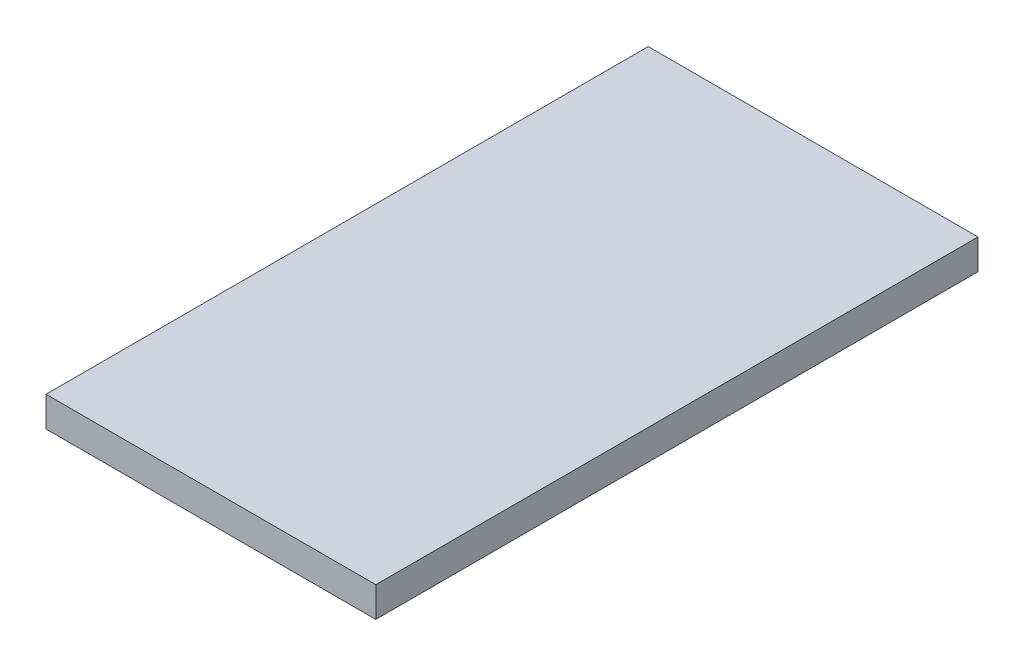
ISO-10303-21;
HEADER;
FILE_DESCRIPTION(('STEP AP214'),'2;1');
FILE_NAME('part.step','',(''),(''),'','','');
FILE_SCHEMA(('AUTOMOTIVE_DESIGN { 1 0 10303 214 1 1 1 1 }'));
ENDSEC;
DATA;
#1=APPLICATION_CONTEXT('core data for automotive mechanical design processes');
#2=APPLICATION_PROTOCOL_DEFINITION('international standard','automotive_design',2000,#1);
#3=PRODUCT_CONTEXT('',#1,'mechanical');
#4=PRODUCT('Part','Part','',(#3));
#5=PRODUCT_RELATED_PRODUCT_CATEGORY('part','',(#4));
#6=PRODUCT_DEFINITION_FORMATION('','',#4);
#7=PRODUCT_DEFINITION_CONTEXT('part definition',#1,'design');
#8=PRODUCT_DEFINITION('design','',#6,#7);
#9=PRODUCT_DEFINITION_SHAPE('','',#8);
#10=(LENGTH_UNIT() NAMED_UNIT(*) SI_UNIT(.MILLI.,.METRE.));
#11=(NAMED_UNIT(*) PLANE_ANGLE_UNIT() SI_UNIT($,.RADIAN.));
#12=(NAMED_UNIT(*) SI_UNIT($,.STERADIAN.) SOLID_ANGLE_UNIT());
#13=UNCERTAINTY_MEASURE_WITH_UNIT(LENGTH_MEASURE(1.E-05),#10,'distance_accuracy_value','');
#14=(GEOMETRIC_REPRESENTATION_CONTEXT(3) GLOBAL_UNCERTAINTY_ASSIGNED_CONTEXT((#13)) GLOBAL_UNIT_ASSIGNED_CONTEXT((#10,
#11,#12)) REPRESENTATION_CONTEXT('',''));
#15=CARTESIAN_POINT('',(0.,0.,0.));
#16=DIRECTION('',(0.,0.,1.));
#17=DIRECTION('',(1.,0.,0.));
#18=AXIS2_PLACEMENT_3D('',#15,#16,#17);
#19=CARTESIAN_POINT('',(-11.5,2.1,-21.));
#20=DIRECTION('',(1.,0.,0.));
#21=DIRECTION('',(0.,0.,-1.));
#22=AXIS2_PLACEMENT_3D('',#19,#20,#21);
#23=PLANE('',#22);
#24=DIRECTION('',(0.,0.,1.));
#25=VECTOR('',#24,1.);
#26=CARTESIAN_POINT('',(-11.5,0.,-21.));
#27=LINE('',#26,#25);
#28=CARTESIAN_POINT('',(-11.5,0.,-21.));
#29=VERTEX_POINT('',#28);
#30=CARTESIAN_POINT('',(-11.5,0.,21.));
#31=VERTEX_POINT('',#30);
#32=EDGE_CURVE('E107',#29,#31,#27,.T.);
#33=ORIENTED_EDGE('',*,*,#32,.T.);
#34=DIRECTION('',(0.,-1.,0.));
#35=VECTOR('',#34,1.);
#36=CARTESIAN_POINT('',(-11.5,2.1,21.));
#37=LINE('',#36,#35);
#38=CARTESIAN_POINT('',(-11.5,2.1,21.));
#39=VERTEX_POINT('',#38);
#40=EDGE_CURVE('E11',#39,#31,#37,.T.);
#41=ORIENTED_EDGE('',*,*,#40,.F.);
#42=DIRECTION('',(0.,0.,1.));
#43=VECTOR('',#42,1.);
#44=CARTESIAN_POINT('',(-11.5,2.1,-21.));
#45=LINE('',#44,#43);
#46=CARTESIAN_POINT('',(-11.5,2.1,-21.));
#47=VERTEX_POINT('',#46);
#48=EDGE_CURVE('E91',#47,#39,#45,.T.);
#49=ORIENTED_EDGE('',*,*,#48,.F.);
#50=DIRECTION('',(0.,-1.,0.));
#51=VECTOR('',#50,1.);
#52=CARTESIAN_POINT('',(-11.5,2.1,-21.));
#53=LINE('',#52,#51);
#54=EDGE_CURVE('E103',#47,#29,#53,.T.);
#55=ORIENTED_EDGE('',*,*,#54,.T.);
#56=EDGE_LOOP('',(#33,#41,#49,#55));
#57=FACE_BOUND('',#56,.T.);
#58=ADVANCED_FACE('F39',(#57),#23,.F.);
#59=CARTESIAN_POINT('',(11.5,2.1,21.));
#60=DIRECTION('',(0.,0.,-1.));
#61=DIRECTION('',(-1.,0.,0.));
#62=AXIS2_PLACEMENT_3D('',#59,#60,#61);
#63=PLANE('',#62);
#64=DIRECTION('',(1.,0.,0.));
#65=VECTOR('',#64,1.);
#66=CARTESIAN_POINT('',(11.5,0.,21.));
#67=LINE('',#66,#65);
#68=CARTESIAN_POINT('',(11.5,0.,21.));
#69=VERTEX_POINT('',#68);
#70=EDGE_CURVE('E96',#31,#69,#67,.T.);
#71=ORIENTED_EDGE('',*,*,#70,.T.);
#72=DIRECTION('',(0.,-1.,0.));
#73=VECTOR('',#72,1.);
#74=CARTESIAN_POINT('',(11.5,2.1,21.));
#75=LINE('',#74,#73);
#76=CARTESIAN_POINT('',(11.5,2.1,21.));
#77=VERTEX_POINT('',#76);
#78=EDGE_CURVE('E48',#77,#69,#75,.T.);
#79=ORIENTED_EDGE('',*,*,#78,.F.);
#80=DIRECTION('',(1.,0.,0.));
#81=VECTOR('',#80,1.);
#82=CARTESIAN_POINT('',(11.5,2.1,21.));
#83=LINE('',#82,#81);
#84=EDGE_CURVE('E86',#39,#77,#83,.T.);
#85=ORIENTED_EDGE('',*,*,#84,.F.);
#86=ORIENTED_EDGE('',*,*,#40,.T.);
#87=EDGE_LOOP('',(#71,#79,#85,#86));
#88=FACE_BOUND('',#87,.T.);
#89=ADVANCED_FACE('F95',(#88),#63,.F.);
#90=CARTESIAN_POINT('',(11.5,2.1,-21.));
#91=DIRECTION('',(-1.,0.,0.));
#92=DIRECTION('',(0.,0.,1.));
#93=AXIS2_PLACEMENT_3D('',#90,#91,#92);
#94=PLANE('',#93);
#95=DIRECTION('',(0.,0.,-1.));
#96=VECTOR('',#95,1.);
#97=CARTESIAN_POINT('',(11.5,0.,-21.));
#98=LINE('',#97,#96);
#99=CARTESIAN_POINT('',(11.5,0.,-21.));
#100=VERTEX_POINT('',#99);
#101=EDGE_CURVE('E73',#69,#100,#98,.T.);
#102=ORIENTED_EDGE('',*,*,#101,.T.);
#103=DIRECTION('',(0.,-1.,0.));
#104=VECTOR('',#103,1.);
#105=CARTESIAN_POINT('',(11.5,2.1,-21.));
#106=LINE('',#105,#104);
#107=CARTESIAN_POINT('',(11.5,2.1,-21.));
#108=VERTEX_POINT('',#107);
#109=EDGE_CURVE('E98',#108,#100,#106,.T.);
#110=ORIENTED_EDGE('',*,*,#109,.F.);
#111=DIRECTION('',(0.,0.,-1.));
#112=VECTOR('',#111,1.);
#113=CARTESIAN_POINT('',(11.5,2.1,-21.));
#114=LINE('',#113,#112);
#115=EDGE_CURVE('E89',#77,#108,#114,.T.);
#116=ORIENTED_EDGE('',*,*,#115,.F.);
#117=ORIENTED_EDGE('',*,*,#78,.T.);
#118=EDGE_LOOP('',(#102,#110,#116,#117));
#119=FACE_BOUND('',#118,.T.);
#120=ADVANCED_FACE('F99',(#119),#94,.F.);
#121=CARTESIAN_POINT('',(11.5,2.1,-21.));
#122=DIRECTION('',(0.,0.,1.));
#123=DIRECTION('',(1.,0.,0.));
#124=AXIS2_PLACEMENT_3D('',#121,#122,#123);
#125=PLANE('',#124);
#126=DIRECTION('',(-1.,0.,0.));
#127=VECTOR('',#126,1.);
#128=CARTESIAN_POINT('',(11.5,0.,-21.));
#129=LINE('',#128,#127);
#130=EDGE_CURVE('E79',#100,#29,#129,.T.);
#131=ORIENTED_EDGE('',*,*,#130,.T.);
#132=ORIENTED_EDGE('',*,*,#54,.F.);
#133=DIRECTION('',(-1.,0.,0.));
#134=VECTOR('',#133,1.);
#135=CARTESIAN_POINT('',(11.5,2.1,-21.));
#136=LINE('',#135,#134);
#137=EDGE_CURVE('E56',#108,#47,#136,.T.);
#138=ORIENTED_EDGE('',*,*,#137,.F.);
#139=ORIENTED_EDGE('',*,*,#109,.T.);
#140=EDGE_LOOP('',(#131,#132,#138,#139));
#141=FACE_BOUND('',#140,.T.);
#142=ADVANCED_FACE('F120',(#141),#125,.F.);
#143=CARTESIAN_POINT('',(0.,2.1,0.));
#144=DIRECTION('',(0.,-1.,0.));
#145=DIRECTION('',(0.,0.,-1.));
#146=AXIS2_PLACEMENT_3D('',#143,#144,#145);
#147=PLANE('',#146);
#148=ORIENTED_EDGE('',*,*,#48,.T.);
#149=ORIENTED_EDGE('',*,*,#84,.T.);
#150=ORIENTED_EDGE('',*,*,#115,.T.);
#151=ORIENTED_EDGE('',*,*,#137,.T.);
#152=EDGE_LOOP('',(#148,#149,#150,#151));
#153=FACE_BOUND('',#152,.T.);
#154=ADVANCED_FACE('F87',(#153),#147,.F.);
#155=CARTESIAN_POINT('',(0.,0.,0.));
#156=DIRECTION('',(0.,-1.,0.));
#157=DIRECTION('',(0.,0.,-1.));
#158=AXIS2_PLACEMENT_3D('',#155,#156,#157);
#159=PLANE('',#158);
#160=ORIENTED_EDGE('',*,*,#32,.F.);
#161=ORIENTED_EDGE('',*,*,#130,.F.);
#162=ORIENTED_EDGE('',*,*,#101,.F.);
#163=ORIENTED_EDGE('',*,*,#70,.F.);
#164=EDGE_LOOP('',(#160,#161,#162,#163));
#165=FACE_BOUND('',#164,.T.);
#166=ADVANCED_FACE('F123',(#165),#159,.T.);
#167=CLOSED_SHELL('',(#58,#89,#120,#142,#154,#166));
#168=MANIFOLD_SOLID_BREP('B2',#167);
#169=ADVANCED_BREP_SHAPE_REPRESENTATION('',(#18,#168),#14);
#170=SHAPE_DEFINITION_REPRESENTATION(#9,#169);
ENDSEC;
END-ISO-10303-21;
